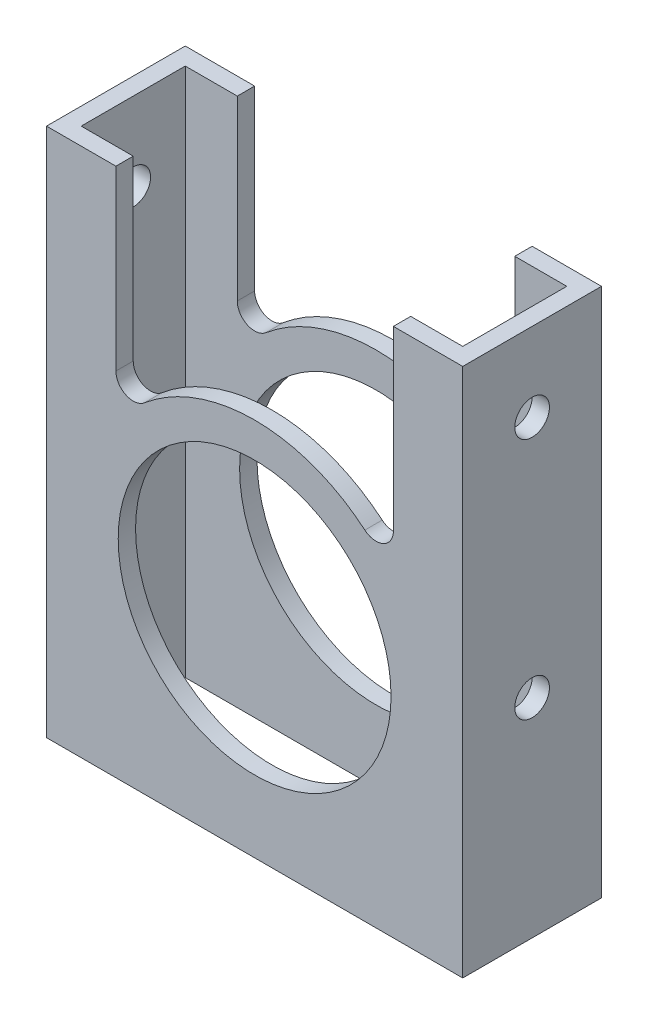
ISO-10303-21;
HEADER;
FILE_DESCRIPTION(('STEP AP214'),'2;1');
FILE_NAME('part.step','',(''),(''),'','','');
FILE_SCHEMA(('AUTOMOTIVE_DESIGN { 1 0 10303 214 1 1 1 1 }'));
ENDSEC;
DATA;
#1=APPLICATION_CONTEXT('core data for automotive mechanical design processes');
#2=APPLICATION_PROTOCOL_DEFINITION('international standard','automotive_design',2000,#1);
#3=PRODUCT_CONTEXT('',#1,'mechanical');
#4=PRODUCT('Part','Part','',(#3));
#5=PRODUCT_RELATED_PRODUCT_CATEGORY('part','',(#4));
#6=PRODUCT_DEFINITION_FORMATION('','',#4);
#7=PRODUCT_DEFINITION_CONTEXT('part definition',#1,'design');
#8=PRODUCT_DEFINITION('design','',#6,#7);
#9=PRODUCT_DEFINITION_SHAPE('','',#8);
#10=(LENGTH_UNIT() NAMED_UNIT(*) SI_UNIT(.MILLI.,.METRE.));
#11=(NAMED_UNIT(*) PLANE_ANGLE_UNIT() SI_UNIT($,.RADIAN.));
#12=(NAMED_UNIT(*) SI_UNIT($,.STERADIAN.) SOLID_ANGLE_UNIT());
#13=UNCERTAINTY_MEASURE_WITH_UNIT(LENGTH_MEASURE(1.E-05),#10,'distance_accuracy_value','');
#14=(GEOMETRIC_REPRESENTATION_CONTEXT(3) GLOBAL_UNCERTAINTY_ASSIGNED_CONTEXT((#13)) GLOBAL_UNIT_ASSIGNED_CONTEXT((#10,
#11,#12)) REPRESENTATION_CONTEXT('',''));
#15=CARTESIAN_POINT('',(0.,0.,0.));
#16=DIRECTION('',(0.,0.,1.));
#17=DIRECTION('',(1.,0.,0.));
#18=AXIS2_PLACEMENT_3D('',#15,#16,#17);
#19=CARTESIAN_POINT('',(0.,-50.8,0.));
#20=DIRECTION('',(0.,1.,0.));
#21=DIRECTION('',(0.,0.,1.));
#22=AXIS2_PLACEMENT_3D('',#19,#20,#21);
#23=PLANE('',#22);
#24=DIRECTION('',(0.,0.,1.));
#25=VECTOR('',#24,1.);
#26=CARTESIAN_POINT('',(0.,-50.8,0.));
#27=LINE('',#26,#25);
#28=CARTESIAN_POINT('',(0.,-50.8,-25.4));
#29=VERTEX_POINT('',#28);
#30=CARTESIAN_POINT('',(0.,-50.8,0.));
#31=VERTEX_POINT('',#30);
#32=EDGE_CURVE('E364',#29,#31,#27,.T.);
#33=ORIENTED_EDGE('',*,*,#32,.F.);
#34=DIRECTION('',(-1.,0.,0.));
#35=VECTOR('',#34,1.);
#36=CARTESIAN_POINT('',(0.,-50.8,-25.4));
#37=LINE('',#36,#35);
#38=CARTESIAN_POINT('',(76.2,-50.8,-25.4));
#39=VERTEX_POINT('',#38);
#40=EDGE_CURVE('E370',#39,#29,#37,.T.);
#41=ORIENTED_EDGE('',*,*,#40,.F.);
#42=DIRECTION('',(0.,0.,-1.));
#43=VECTOR('',#42,1.);
#44=CARTESIAN_POINT('',(76.2,-50.8,0.));
#45=LINE('',#44,#43);
#46=CARTESIAN_POINT('',(76.2,-50.8,0.));
#47=VERTEX_POINT('',#46);
#48=EDGE_CURVE('E368',#47,#39,#45,.T.);
#49=ORIENTED_EDGE('',*,*,#48,.F.);
#50=DIRECTION('',(1.,0.,0.));
#51=VECTOR('',#50,1.);
#52=CARTESIAN_POINT('',(0.,-50.8,0.));
#53=LINE('',#52,#51);
#54=EDGE_CURVE('E219',#31,#47,#53,.T.);
#55=ORIENTED_EDGE('',*,*,#54,.F.);
#56=EDGE_LOOP('',(#33,#41,#49,#55));
#57=FACE_BOUND('',#56,.T.);
#58=DIRECTION('',(0.,0.,1.));
#59=VECTOR('',#58,1.);
#60=CARTESIAN_POINT('',(3.175,-50.8,0.));
#61=LINE('',#60,#59);
#62=CARTESIAN_POINT('',(3.175,-50.8,-22.225));
#63=VERTEX_POINT('',#62);
#64=CARTESIAN_POINT('',(3.175,-50.8,-3.175));
#65=VERTEX_POINT('',#64);
#66=EDGE_CURVE('E344',#63,#65,#61,.T.);
#67=ORIENTED_EDGE('',*,*,#66,.T.);
#68=DIRECTION('',(1.,0.,0.));
#69=VECTOR('',#68,1.);
#70=CARTESIAN_POINT('',(0.,-50.8,-3.175));
#71=LINE('',#70,#69);
#72=CARTESIAN_POINT('',(73.025,-50.8,-3.175));
#73=VERTEX_POINT('',#72);
#74=EDGE_CURVE('E347',#65,#73,#71,.T.);
#75=ORIENTED_EDGE('',*,*,#74,.T.);
#76=DIRECTION('',(0.,0.,-1.));
#77=VECTOR('',#76,1.);
#78=CARTESIAN_POINT('',(73.025,-50.8,0.));
#79=LINE('',#78,#77);
#80=CARTESIAN_POINT('',(73.025,-50.8,-22.225));
#81=VERTEX_POINT('',#80);
#82=EDGE_CURVE('E350',#73,#81,#79,.T.);
#83=ORIENTED_EDGE('',*,*,#82,.T.);
#84=DIRECTION('',(-1.,0.,0.));
#85=VECTOR('',#84,1.);
#86=CARTESIAN_POINT('',(0.,-50.8,-22.225));
#87=LINE('',#86,#85);
#88=EDGE_CURVE('E353',#81,#63,#87,.T.);
#89=ORIENTED_EDGE('',*,*,#88,.T.);
#90=EDGE_LOOP('',(#67,#75,#83,#89));
#91=FACE_BOUND('',#90,.T.);
#92=ADVANCED_FACE('F61',(#57,#91),#23,.F.);
#93=CARTESIAN_POINT('',(0.,50.8,0.));
#94=DIRECTION('',(1.,0.,0.));
#95=DIRECTION('',(0.,0.,-1.));
#96=AXIS2_PLACEMENT_3D('',#93,#94,#95);
#97=PLANE('',#96);
#98=CARTESIAN_POINT('',(0.,-12.7,-12.7));
#99=DIRECTION('',(-1.,0.,0.));
#100=DIRECTION('',(0.,0.,1.));
#101=AXIS2_PLACEMENT_3D('',#98,#99,#100);
#102=CIRCLE('',#101,3.175);
#103=CARTESIAN_POINT('',(0.,-12.7,-9.525));
#104=VERTEX_POINT('',#103);
#105=EDGE_CURVE('E507',#104,#104,#102,.T.);
#106=ORIENTED_EDGE('',*,*,#105,.F.);
#107=EDGE_LOOP('',(#106));
#108=FACE_BOUND('',#107,.T.);
#109=CARTESIAN_POINT('',(0.,31.75,-12.7));
#110=DIRECTION('',(-1.,0.,0.));
#111=DIRECTION('',(0.,0.,1.));
#112=AXIS2_PLACEMENT_3D('',#109,#110,#111);
#113=CIRCLE('',#112,3.175);
#114=CARTESIAN_POINT('',(0.,31.75,-9.525));
#115=VERTEX_POINT('',#114);
#116=EDGE_CURVE('E256',#115,#115,#113,.T.);
#117=ORIENTED_EDGE('',*,*,#116,.F.);
#118=EDGE_LOOP('',(#117));
#119=FACE_BOUND('',#118,.T.);
#120=DIRECTION('',(0.,-1.,0.));
#121=VECTOR('',#120,1.);
#122=CARTESIAN_POINT('',(0.,50.8,0.));
#123=LINE('',#122,#121);
#124=CARTESIAN_POINT('',(0.,46.1645,0.));
#125=VERTEX_POINT('',#124);
#126=EDGE_CURVE('E221',#125,#31,#123,.T.);
#127=ORIENTED_EDGE('',*,*,#126,.F.);
#128=DIRECTION('',(0.,0.,-1.));
#129=VECTOR('',#128,1.);
#130=CARTESIAN_POINT('',(0.,46.1645,0.));
#131=LINE('',#130,#129);
#132=CARTESIAN_POINT('',(0.,46.1645,-25.4));
#133=VERTEX_POINT('',#132);
#134=EDGE_CURVE('E292',#125,#133,#131,.T.);
#135=ORIENTED_EDGE('',*,*,#134,.T.);
#136=DIRECTION('',(0.,-1.,0.));
#137=VECTOR('',#136,1.);
#138=CARTESIAN_POINT('',(0.,50.8,-25.4));
#139=LINE('',#138,#137);
#140=EDGE_CURVE('E225',#133,#29,#139,.T.);
#141=ORIENTED_EDGE('',*,*,#140,.T.);
#142=ORIENTED_EDGE('',*,*,#32,.T.);
#143=EDGE_LOOP('',(#127,#135,#141,#142));
#144=FACE_BOUND('',#143,.T.);
#145=ADVANCED_FACE('F63',(#108,#119,#144),#97,.F.);
#146=CARTESIAN_POINT('',(0.,50.8,0.));
#147=DIRECTION('',(0.,0.,-1.));
#148=DIRECTION('',(-1.,0.,0.));
#149=AXIS2_PLACEMENT_3D('',#146,#147,#148);
#150=PLANE('',#149);
#151=CARTESIAN_POINT('',(38.1,-12.7,0.));
#152=DIRECTION('',(0.,0.,-1.));
#153=DIRECTION('',(-1.,0.,0.));
#154=AXIS2_PLACEMENT_3D('',#151,#152,#153);
#155=CIRCLE('',#154,24.97201);
#156=CARTESIAN_POINT('',(13.12799,-12.7,0.));
#157=VERTEX_POINT('',#156);
#158=EDGE_CURVE('E341',#157,#157,#155,.T.);
#159=ORIENTED_EDGE('',*,*,#158,.T.);
#160=EDGE_LOOP('',(#159));
#161=FACE_BOUND('',#160,.T.);
#162=DIRECTION('',(0.,-1.,0.));
#163=VECTOR('',#162,1.);
#164=CARTESIAN_POINT('',(12.7,0.,0.));
#165=LINE('',#164,#163);
#166=CARTESIAN_POINT('',(12.7,46.1645,0.));
#167=VERTEX_POINT('',#166);
#168=CARTESIAN_POINT('',(12.7,13.6835758368744,0.));
#169=VERTEX_POINT('',#168);
#170=EDGE_CURVE('E274',#167,#169,#165,.T.);
#171=ORIENTED_EDGE('',*,*,#170,.F.);
#172=DIRECTION('',(-1.,0.,0.));
#173=VECTOR('',#172,1.);
#174=CARTESIAN_POINT('',(0.,46.1645,0.));
#175=LINE('',#174,#173);
#176=EDGE_CURVE('E207',#167,#125,#175,.T.);
#177=ORIENTED_EDGE('',*,*,#176,.T.);
#178=ORIENTED_EDGE('',*,*,#126,.T.);
#179=ORIENTED_EDGE('',*,*,#54,.T.);
#180=DIRECTION('',(0.,-1.,0.));
#181=VECTOR('',#180,1.);
#182=CARTESIAN_POINT('',(76.2,50.8,0.));
#183=LINE('',#182,#181);
#184=CARTESIAN_POINT('',(76.2,46.1645,0.));
#185=VERTEX_POINT('',#184);
#186=EDGE_CURVE('E212',#185,#47,#183,.T.);
#187=ORIENTED_EDGE('',*,*,#186,.F.);
#188=CARTESIAN_POINT('',(63.5,46.1645,0.));
#189=VERTEX_POINT('',#188);
#190=EDGE_CURVE('E196',#185,#189,#175,.T.);
#191=ORIENTED_EDGE('',*,*,#190,.T.);
#192=DIRECTION('',(0.,-1.,0.));
#193=VECTOR('',#192,1.);
#194=CARTESIAN_POINT('',(63.5,0.,0.));
#195=LINE('',#194,#193);
#196=CARTESIAN_POINT('',(63.5,13.6835758368744,0.));
#197=VERTEX_POINT('',#196);
#198=EDGE_CURVE('E204',#189,#197,#195,.T.);
#199=ORIENTED_EDGE('',*,*,#198,.T.);
#200=CARTESIAN_POINT('',(60.325,13.6835758368744,0.));
#201=DIRECTION('',(0.,0.,-1.));
#202=DIRECTION('',(-1.,0.,0.));
#203=AXIS2_PLACEMENT_3D('',#200,#201,#202);
#204=CIRCLE('',#203,3.175);
#205=CARTESIAN_POINT('',(58.2794785185731,11.2553116689921,0.));
#206=VERTEX_POINT('',#205);
#207=EDGE_CURVE('E267',#206,#197,#204,.F.);
#208=ORIENTED_EDGE('',*,*,#207,.F.);
#209=CARTESIAN_POINT('',(38.1,-12.7,0.));
#210=DIRECTION('',(0.,0.,-1.));
#211=DIRECTION('',(-1.,0.,0.));
#212=AXIS2_PLACEMENT_3D('',#209,#210,#211);
#213=CIRCLE('',#212,31.32201);
#214=CARTESIAN_POINT('',(17.9205214814269,11.2553116689921,0.));
#215=VERTEX_POINT('',#214);
#216=EDGE_CURVE('E269',#215,#206,#213,.T.);
#217=ORIENTED_EDGE('',*,*,#216,.F.);
#218=CARTESIAN_POINT('',(15.875,13.6835758368744,0.));
#219=DIRECTION('',(0.,0.,-1.));
#220=DIRECTION('',(-1.,0.,0.));
#221=AXIS2_PLACEMENT_3D('',#218,#219,#220);
#222=CIRCLE('',#221,3.175);
#223=EDGE_CURVE('E271',#215,#169,#222,.T.);
#224=ORIENTED_EDGE('',*,*,#223,.T.);
#225=EDGE_LOOP('',(#171,#177,#178,#179,#187,#191,#199,#208,#217,#224));
#226=FACE_BOUND('',#225,.T.);
#227=ADVANCED_FACE('F217',(#161,#226),#150,.F.);
#228=CARTESIAN_POINT('',(76.2,50.8,0.));
#229=DIRECTION('',(-1.,0.,0.));
#230=DIRECTION('',(0.,0.,1.));
#231=AXIS2_PLACEMENT_3D('',#228,#229,#230);
#232=PLANE('',#231);
#233=CARTESIAN_POINT('',(76.2,-12.7,-12.7));
#234=DIRECTION('',(-1.,0.,0.));
#235=DIRECTION('',(0.,0.,1.));
#236=AXIS2_PLACEMENT_3D('',#233,#234,#235);
#237=CIRCLE('',#236,3.175);
#238=CARTESIAN_POINT('',(76.2,-12.7,-9.525));
#239=VERTEX_POINT('',#238);
#240=EDGE_CURVE('E505',#239,#239,#237,.T.);
#241=ORIENTED_EDGE('',*,*,#240,.T.);
#242=EDGE_LOOP('',(#241));
#243=FACE_BOUND('',#242,.T.);
#244=CARTESIAN_POINT('',(76.2,31.75,-12.7));
#245=DIRECTION('',(-1.,0.,0.));
#246=DIRECTION('',(0.,0.,1.));
#247=AXIS2_PLACEMENT_3D('',#244,#245,#246);
#248=CIRCLE('',#247,3.175);
#249=CARTESIAN_POINT('',(76.2,31.75,-9.525));
#250=VERTEX_POINT('',#249);
#251=EDGE_CURVE('E249',#250,#250,#248,.T.);
#252=ORIENTED_EDGE('',*,*,#251,.T.);
#253=EDGE_LOOP('',(#252));
#254=FACE_BOUND('',#253,.T.);
#255=DIRECTION('',(0.,-1.,0.));
#256=VECTOR('',#255,1.);
#257=CARTESIAN_POINT('',(76.2,50.8,-25.4));
#258=LINE('',#257,#256);
#259=CARTESIAN_POINT('',(76.2,46.1645,-25.4));
#260=VERTEX_POINT('',#259);
#261=EDGE_CURVE('E214',#260,#39,#258,.T.);
#262=ORIENTED_EDGE('',*,*,#261,.F.);
#263=DIRECTION('',(0.,0.,-1.));
#264=VECTOR('',#263,1.);
#265=CARTESIAN_POINT('',(76.2,46.1645,0.));
#266=LINE('',#265,#264);
#267=EDGE_CURVE('E78',#185,#260,#266,.T.);
#268=ORIENTED_EDGE('',*,*,#267,.F.);
#269=ORIENTED_EDGE('',*,*,#186,.T.);
#270=ORIENTED_EDGE('',*,*,#48,.T.);
#271=EDGE_LOOP('',(#262,#268,#269,#270));
#272=FACE_BOUND('',#271,.T.);
#273=ADVANCED_FACE('F210',(#243,#254,#272),#232,.F.);
#274=CARTESIAN_POINT('',(0.,50.8,-25.4));
#275=DIRECTION('',(0.,0.,1.));
#276=DIRECTION('',(1.,0.,0.));
#277=AXIS2_PLACEMENT_3D('',#274,#275,#276);
#278=PLANE('',#277);
#279=CARTESIAN_POINT('',(38.1,-12.7,-25.4));
#280=DIRECTION('',(0.,0.,-1.));
#281=DIRECTION('',(-1.,0.,0.));
#282=AXIS2_PLACEMENT_3D('',#279,#280,#281);
#283=CIRCLE('',#282,24.97201);
#284=CARTESIAN_POINT('',(13.12799,-12.7,-25.4));
#285=VERTEX_POINT('',#284);
#286=EDGE_CURVE('E233',#285,#285,#283,.T.);
#287=ORIENTED_EDGE('',*,*,#286,.F.);
#288=EDGE_LOOP('',(#287));
#289=FACE_BOUND('',#288,.T.);
#290=ORIENTED_EDGE('',*,*,#140,.F.);
#291=DIRECTION('',(-1.,0.,0.));
#292=VECTOR('',#291,1.);
#293=CARTESIAN_POINT('',(0.,46.1645,-25.4));
#294=LINE('',#293,#292);
#295=CARTESIAN_POINT('',(12.7,46.1645,-25.4));
#296=VERTEX_POINT('',#295);
#297=EDGE_CURVE('E205',#296,#133,#294,.T.);
#298=ORIENTED_EDGE('',*,*,#297,.F.);
#299=DIRECTION('',(0.,-1.,0.));
#300=VECTOR('',#299,1.);
#301=CARTESIAN_POINT('',(12.7,0.,-25.4));
#302=LINE('',#301,#300);
#303=CARTESIAN_POINT('',(12.7,13.6835758368744,-25.4));
#304=VERTEX_POINT('',#303);
#305=EDGE_CURVE('E289',#296,#304,#302,.T.);
#306=ORIENTED_EDGE('',*,*,#305,.T.);
#307=CARTESIAN_POINT('',(15.875,13.6835758368744,-25.4));
#308=DIRECTION('',(0.,0.,-1.));
#309=DIRECTION('',(-1.,0.,0.));
#310=AXIS2_PLACEMENT_3D('',#307,#308,#309);
#311=CIRCLE('',#310,3.175);
#312=CARTESIAN_POINT('',(17.9205214814269,11.2553116689921,-25.4));
#313=VERTEX_POINT('',#312);
#314=EDGE_CURVE('E286',#313,#304,#311,.T.);
#315=ORIENTED_EDGE('',*,*,#314,.F.);
#316=CARTESIAN_POINT('',(38.1,-12.7,-25.4));
#317=DIRECTION('',(0.,0.,-1.));
#318=DIRECTION('',(-1.,0.,0.));
#319=AXIS2_PLACEMENT_3D('',#316,#317,#318);
#320=CIRCLE('',#319,31.32201);
#321=CARTESIAN_POINT('',(58.2794785185731,11.2553116689921,-25.4));
#322=VERTEX_POINT('',#321);
#323=EDGE_CURVE('E283',#313,#322,#320,.T.);
#324=ORIENTED_EDGE('',*,*,#323,.T.);
#325=CARTESIAN_POINT('',(60.325,13.6835758368744,-25.4));
#326=DIRECTION('',(0.,0.,-1.));
#327=DIRECTION('',(-1.,0.,0.));
#328=AXIS2_PLACEMENT_3D('',#325,#326,#327);
#329=CIRCLE('',#328,3.175);
#330=CARTESIAN_POINT('',(63.5,13.6835758368744,-25.4));
#331=VERTEX_POINT('',#330);
#332=EDGE_CURVE('E280',#322,#331,#329,.F.);
#333=ORIENTED_EDGE('',*,*,#332,.T.);
#334=DIRECTION('',(0.,-1.,0.));
#335=VECTOR('',#334,1.);
#336=CARTESIAN_POINT('',(63.5,0.,-25.4));
#337=LINE('',#336,#335);
#338=CARTESIAN_POINT('',(63.5,46.1645,-25.4));
#339=VERTEX_POINT('',#338);
#340=EDGE_CURVE('E277',#339,#331,#337,.T.);
#341=ORIENTED_EDGE('',*,*,#340,.F.);
#342=EDGE_CURVE('E253',#260,#339,#294,.T.);
#343=ORIENTED_EDGE('',*,*,#342,.F.);
#344=ORIENTED_EDGE('',*,*,#261,.T.);
#345=ORIENTED_EDGE('',*,*,#40,.T.);
#346=EDGE_LOOP('',(#290,#298,#306,#315,#324,#333,#341,#343,#344,#345));
#347=FACE_BOUND('',#346,.T.);
#348=ADVANCED_FACE('F379',(#289,#347),#278,.F.);
#349=CARTESIAN_POINT('',(3.175,50.8,0.));
#350=DIRECTION('',(1.,0.,0.));
#351=DIRECTION('',(0.,0.,-1.));
#352=AXIS2_PLACEMENT_3D('',#349,#350,#351);
#353=PLANE('',#352);
#354=CARTESIAN_POINT('',(3.175,-12.7,-12.7));
#355=DIRECTION('',(1.,0.,0.));
#356=DIRECTION('',(0.,0.,-1.));
#357=AXIS2_PLACEMENT_3D('',#354,#355,#356);
#358=CIRCLE('',#357,3.175);
#359=CARTESIAN_POINT('',(3.175,-12.7,-15.875));
#360=VERTEX_POINT('',#359);
#361=EDGE_CURVE('E261',#360,#360,#358,.T.);
#362=ORIENTED_EDGE('',*,*,#361,.F.);
#363=EDGE_LOOP('',(#362));
#364=FACE_BOUND('',#363,.T.);
#365=CARTESIAN_POINT('',(3.175,31.75,-12.7));
#366=DIRECTION('',(1.,0.,0.));
#367=DIRECTION('',(0.,0.,-1.));
#368=AXIS2_PLACEMENT_3D('',#365,#366,#367);
#369=CIRCLE('',#368,3.175);
#370=CARTESIAN_POINT('',(3.175,31.75,-15.875));
#371=VERTEX_POINT('',#370);
#372=EDGE_CURVE('E248',#371,#371,#369,.T.);
#373=ORIENTED_EDGE('',*,*,#372,.F.);
#374=EDGE_LOOP('',(#373));
#375=FACE_BOUND('',#374,.T.);
#376=DIRECTION('',(0.,0.,-1.));
#377=VECTOR('',#376,1.);
#378=CARTESIAN_POINT('',(3.175,46.1645,0.));
#379=LINE('',#378,#377);
#380=CARTESIAN_POINT('',(3.175,46.1645,-3.175));
#381=VERTEX_POINT('',#380);
#382=CARTESIAN_POINT('',(3.175,46.1645,-22.225));
#383=VERTEX_POINT('',#382);
#384=EDGE_CURVE('E333',#381,#383,#379,.T.);
#385=ORIENTED_EDGE('',*,*,#384,.F.);
#386=DIRECTION('',(0.,-1.,0.));
#387=VECTOR('',#386,1.);
#388=CARTESIAN_POINT('',(3.175,50.8,-3.175));
#389=LINE('',#388,#387);
#390=EDGE_CURVE('E362',#381,#65,#389,.T.);
#391=ORIENTED_EDGE('',*,*,#390,.T.);
#392=ORIENTED_EDGE('',*,*,#66,.F.);
#393=DIRECTION('',(0.,-1.,0.));
#394=VECTOR('',#393,1.);
#395=CARTESIAN_POINT('',(3.175,50.8,-22.225));
#396=LINE('',#395,#394);
#397=EDGE_CURVE('E356',#383,#63,#396,.T.);
#398=ORIENTED_EDGE('',*,*,#397,.F.);
#399=EDGE_LOOP('',(#385,#391,#392,#398));
#400=FACE_BOUND('',#399,.T.);
#401=ADVANCED_FACE('F390',(#364,#375,#400),#353,.T.);
#402=CARTESIAN_POINT('',(0.,50.8,-3.175));
#403=DIRECTION('',(0.,0.,-1.));
#404=DIRECTION('',(-1.,0.,0.));
#405=AXIS2_PLACEMENT_3D('',#402,#403,#404);
#406=PLANE('',#405);
#407=DIRECTION('',(-1.,0.,0.));
#408=VECTOR('',#407,1.);
#409=CARTESIAN_POINT('',(0.,46.1645,-3.175));
#410=LINE('',#409,#408);
#411=CARTESIAN_POINT('',(12.7,46.1645,-3.175));
#412=VERTEX_POINT('',#411);
#413=EDGE_CURVE('E335',#412,#381,#410,.T.);
#414=ORIENTED_EDGE('',*,*,#413,.F.);
#415=DIRECTION('',(0.,-1.,0.));
#416=VECTOR('',#415,1.);
#417=CARTESIAN_POINT('',(12.7,50.8,-3.175));
#418=LINE('',#417,#416);
#419=CARTESIAN_POINT('',(12.7,13.6835758368744,-3.175));
#420=VERTEX_POINT('',#419);
#421=EDGE_CURVE('E330',#412,#420,#418,.T.);
#422=ORIENTED_EDGE('',*,*,#421,.T.);
#423=CARTESIAN_POINT('',(15.875,13.6835758368744,-3.175));
#424=DIRECTION('',(0.,0.,-1.));
#425=DIRECTION('',(-1.,0.,0.));
#426=AXIS2_PLACEMENT_3D('',#423,#424,#425);
#427=CIRCLE('',#426,3.175);
#428=CARTESIAN_POINT('',(17.9205214814269,11.2553116689921,-3.175));
#429=VERTEX_POINT('',#428);
#430=EDGE_CURVE('E328',#429,#420,#427,.T.);
#431=ORIENTED_EDGE('',*,*,#430,.F.);
#432=CARTESIAN_POINT('',(38.1,-12.7,-3.175));
#433=DIRECTION('',(0.,0.,-1.));
#434=DIRECTION('',(-1.,0.,0.));
#435=AXIS2_PLACEMENT_3D('',#432,#433,#434);
#436=CIRCLE('',#435,31.32201);
#437=CARTESIAN_POINT('',(58.2794785185731,11.2553116689921,-3.175));
#438=VERTEX_POINT('',#437);
#439=EDGE_CURVE('E325',#429,#438,#436,.T.);
#440=ORIENTED_EDGE('',*,*,#439,.T.);
#441=CARTESIAN_POINT('',(60.325,13.6835758368744,-3.175));
#442=DIRECTION('',(0.,0.,-1.));
#443=DIRECTION('',(-1.,0.,0.));
#444=AXIS2_PLACEMENT_3D('',#441,#442,#443);
#445=CIRCLE('',#444,3.175);
#446=CARTESIAN_POINT('',(63.5,13.6835758368744,-3.175));
#447=VERTEX_POINT('',#446);
#448=EDGE_CURVE('E322',#438,#447,#445,.F.);
#449=ORIENTED_EDGE('',*,*,#448,.T.);
#450=DIRECTION('',(0.,-1.,0.));
#451=VECTOR('',#450,1.);
#452=CARTESIAN_POINT('',(63.5,50.8,-3.175));
#453=LINE('',#452,#451);
#454=CARTESIAN_POINT('',(63.5,46.1645,-3.175));
#455=VERTEX_POINT('',#454);
#456=EDGE_CURVE('E320',#455,#447,#453,.T.);
#457=ORIENTED_EDGE('',*,*,#456,.F.);
#458=DIRECTION('',(-1.,0.,0.));
#459=VECTOR('',#458,1.);
#460=CARTESIAN_POINT('',(0.,46.1645,-3.175));
#461=LINE('',#460,#459);
#462=CARTESIAN_POINT('',(73.025,46.1645,-3.175));
#463=VERTEX_POINT('',#462);
#464=EDGE_CURVE('E318',#463,#455,#461,.T.);
#465=ORIENTED_EDGE('',*,*,#464,.F.);
#466=DIRECTION('',(0.,-1.,0.));
#467=VECTOR('',#466,1.);
#468=CARTESIAN_POINT('',(73.025,50.8,-3.175));
#469=LINE('',#468,#467);
#470=EDGE_CURVE('E360',#463,#73,#469,.T.);
#471=ORIENTED_EDGE('',*,*,#470,.T.);
#472=ORIENTED_EDGE('',*,*,#74,.F.);
#473=ORIENTED_EDGE('',*,*,#390,.F.);
#474=EDGE_LOOP('',(#414,#422,#431,#440,#449,#457,#465,#471,#472,#473));
#475=FACE_BOUND('',#474,.T.);
#476=CARTESIAN_POINT('',(38.1,-12.7,-3.175));
#477=DIRECTION('',(0.,0.,-1.));
#478=DIRECTION('',(-1.,0.,0.));
#479=AXIS2_PLACEMENT_3D('',#476,#477,#478);
#480=CIRCLE('',#479,24.97201);
#481=CARTESIAN_POINT('',(13.12799,-12.7,-3.175));
#482=VERTEX_POINT('',#481);
#483=EDGE_CURVE('E232',#482,#482,#480,.T.);
#484=ORIENTED_EDGE('',*,*,#483,.F.);
#485=EDGE_LOOP('',(#484));
#486=FACE_BOUND('',#485,.T.);
#487=ADVANCED_FACE('F394',(#475,#486),#406,.T.);
#488=CARTESIAN_POINT('',(73.025,50.8,0.));
#489=DIRECTION('',(-1.,0.,0.));
#490=DIRECTION('',(0.,0.,1.));
#491=AXIS2_PLACEMENT_3D('',#488,#489,#490);
#492=PLANE('',#491);
#493=CARTESIAN_POINT('',(73.025,-12.7,-12.7));
#494=DIRECTION('',(-1.,0.,0.));
#495=DIRECTION('',(0.,0.,1.));
#496=AXIS2_PLACEMENT_3D('',#493,#494,#495);
#497=CIRCLE('',#496,3.175);
#498=CARTESIAN_POINT('',(73.025,-12.7,-9.525));
#499=VERTEX_POINT('',#498);
#500=EDGE_CURVE('E65',#499,#499,#497,.T.);
#501=ORIENTED_EDGE('',*,*,#500,.F.);
#502=EDGE_LOOP('',(#501));
#503=FACE_BOUND('',#502,.T.);
#504=CARTESIAN_POINT('',(73.025,31.75,-12.7));
#505=DIRECTION('',(-1.,0.,0.));
#506=DIRECTION('',(0.,0.,1.));
#507=AXIS2_PLACEMENT_3D('',#504,#505,#506);
#508=CIRCLE('',#507,3.175);
#509=CARTESIAN_POINT('',(73.025,31.75,-9.525));
#510=VERTEX_POINT('',#509);
#511=EDGE_CURVE('E246',#510,#510,#508,.T.);
#512=ORIENTED_EDGE('',*,*,#511,.F.);
#513=EDGE_LOOP('',(#512));
#514=FACE_BOUND('',#513,.T.);
#515=DIRECTION('',(0.,0.,1.));
#516=VECTOR('',#515,1.);
#517=CARTESIAN_POINT('',(73.025,46.1645,0.));
#518=LINE('',#517,#516);
#519=CARTESIAN_POINT('',(73.025,46.1645,-22.225));
#520=VERTEX_POINT('',#519);
#521=EDGE_CURVE('E295',#520,#463,#518,.T.);
#522=ORIENTED_EDGE('',*,*,#521,.F.);
#523=DIRECTION('',(0.,-1.,0.));
#524=VECTOR('',#523,1.);
#525=CARTESIAN_POINT('',(73.025,50.8,-22.225));
#526=LINE('',#525,#524);
#527=EDGE_CURVE('E358',#520,#81,#526,.T.);
#528=ORIENTED_EDGE('',*,*,#527,.T.);
#529=ORIENTED_EDGE('',*,*,#82,.F.);
#530=ORIENTED_EDGE('',*,*,#470,.F.);
#531=EDGE_LOOP('',(#522,#528,#529,#530));
#532=FACE_BOUND('',#531,.T.);
#533=ADVANCED_FACE('F402',(#503,#514,#532),#492,.T.);
#534=CARTESIAN_POINT('',(0.,50.8,-22.225));
#535=DIRECTION('',(0.,0.,1.));
#536=DIRECTION('',(1.,0.,0.));
#537=AXIS2_PLACEMENT_3D('',#534,#535,#536);
#538=PLANE('',#537);
#539=DIRECTION('',(1.,0.,0.));
#540=VECTOR('',#539,1.);
#541=CARTESIAN_POINT('',(0.,46.1645,-22.225));
#542=LINE('',#541,#540);
#543=CARTESIAN_POINT('',(12.7,46.1645,-22.225));
#544=VERTEX_POINT('',#543);
#545=EDGE_CURVE('E12',#383,#544,#542,.T.);
#546=ORIENTED_EDGE('',*,*,#545,.F.);
#547=ORIENTED_EDGE('',*,*,#397,.T.);
#548=ORIENTED_EDGE('',*,*,#88,.F.);
#549=ORIENTED_EDGE('',*,*,#527,.F.);
#550=DIRECTION('',(1.,0.,0.));
#551=VECTOR('',#550,1.);
#552=CARTESIAN_POINT('',(0.,46.1645,-22.225));
#553=LINE('',#552,#551);
#554=CARTESIAN_POINT('',(63.5,46.1645,-22.225));
#555=VERTEX_POINT('',#554);
#556=EDGE_CURVE('E223',#555,#520,#553,.T.);
#557=ORIENTED_EDGE('',*,*,#556,.F.);
#558=DIRECTION('',(0.,1.,0.));
#559=VECTOR('',#558,1.);
#560=CARTESIAN_POINT('',(63.5,50.8,-22.225));
#561=LINE('',#560,#559);
#562=CARTESIAN_POINT('',(63.5,13.6835758368744,-22.225));
#563=VERTEX_POINT('',#562);
#564=EDGE_CURVE('E235',#563,#555,#561,.T.);
#565=ORIENTED_EDGE('',*,*,#564,.F.);
#566=CARTESIAN_POINT('',(60.325,13.6835758368744,-22.225));
#567=DIRECTION('',(0.,0.,1.));
#568=DIRECTION('',(1.,0.,0.));
#569=AXIS2_PLACEMENT_3D('',#566,#567,#568);
#570=CIRCLE('',#569,3.175);
#571=CARTESIAN_POINT('',(58.2794785185731,11.2553116689921,-22.225));
#572=VERTEX_POINT('',#571);
#573=EDGE_CURVE('E237',#563,#572,#570,.F.);
#574=ORIENTED_EDGE('',*,*,#573,.T.);
#575=CARTESIAN_POINT('',(38.1,-12.7,-22.225));
#576=DIRECTION('',(0.,0.,1.));
#577=DIRECTION('',(1.,0.,0.));
#578=AXIS2_PLACEMENT_3D('',#575,#576,#577);
#579=CIRCLE('',#578,31.32201);
#580=CARTESIAN_POINT('',(17.9205214814269,11.2553116689921,-22.225));
#581=VERTEX_POINT('',#580);
#582=EDGE_CURVE('E240',#572,#581,#579,.T.);
#583=ORIENTED_EDGE('',*,*,#582,.T.);
#584=CARTESIAN_POINT('',(15.875,13.6835758368744,-22.225));
#585=DIRECTION('',(0.,0.,1.));
#586=DIRECTION('',(1.,0.,0.));
#587=AXIS2_PLACEMENT_3D('',#584,#585,#586);
#588=CIRCLE('',#587,3.175);
#589=CARTESIAN_POINT('',(12.7,13.6835758368744,-22.225));
#590=VERTEX_POINT('',#589);
#591=EDGE_CURVE('E243',#590,#581,#588,.T.);
#592=ORIENTED_EDGE('',*,*,#591,.F.);
#593=DIRECTION('',(0.,1.,0.));
#594=VECTOR('',#593,1.);
#595=CARTESIAN_POINT('',(12.7,50.8,-22.225));
#596=LINE('',#595,#594);
#597=EDGE_CURVE('E70',#590,#544,#596,.T.);
#598=ORIENTED_EDGE('',*,*,#597,.T.);
#599=EDGE_LOOP('',(#546,#547,#548,#549,#557,#565,#574,#583,#592,#598));
#600=FACE_BOUND('',#599,.T.);
#601=CARTESIAN_POINT('',(38.1,-12.7,-22.225));
#602=DIRECTION('',(0.,0.,1.));
#603=DIRECTION('',(1.,0.,0.));
#604=AXIS2_PLACEMENT_3D('',#601,#602,#603);
#605=CIRCLE('',#604,24.97201);
#606=CARTESIAN_POINT('',(63.07201,-12.7,-22.225));
#607=VERTEX_POINT('',#606);
#608=EDGE_CURVE('E229',#607,#607,#605,.T.);
#609=ORIENTED_EDGE('',*,*,#608,.F.);
#610=EDGE_LOOP('',(#609));
#611=FACE_BOUND('',#610,.T.);
#612=ADVANCED_FACE('F407',(#600,#611),#538,.T.);
#613=CARTESIAN_POINT('',(38.1,-12.7,27.178));
#614=DIRECTION('',(0.,0.,-1.));
#615=DIRECTION('',(-1.,0.,0.));
#616=AXIS2_PLACEMENT_3D('',#613,#614,#615);
#617=CYLINDRICAL_SURFACE('',#616,24.97201);
#618=ORIENTED_EDGE('',*,*,#608,.T.);
#619=EDGE_LOOP('',(#618));
#620=FACE_BOUND('',#619,.T.);
#621=ORIENTED_EDGE('',*,*,#286,.T.);
#622=EDGE_LOOP('',(#621));
#623=FACE_BOUND('',#622,.T.);
#624=ADVANCED_FACE('F484',(#620,#623),#617,.F.);
#625=ORIENTED_EDGE('',*,*,#483,.T.);
#626=EDGE_LOOP('',(#625));
#627=FACE_BOUND('',#626,.T.);
#628=ORIENTED_EDGE('',*,*,#158,.F.);
#629=EDGE_LOOP('',(#628));
#630=FACE_BOUND('',#629,.T.);
#631=ADVANCED_FACE('F480',(#627,#630),#617,.F.);
#632=CARTESIAN_POINT('',(12.7,0.,0.));
#633=DIRECTION('',(1.,0.,0.));
#634=DIRECTION('',(0.,1.,0.));
#635=AXIS2_PLACEMENT_3D('',#632,#633,#634);
#636=PLANE('',#635);
#637=DIRECTION('',(0.,0.,-1.));
#638=VECTOR('',#637,1.);
#639=CARTESIAN_POINT('',(12.7,46.1645,0.));
#640=LINE('',#639,#638);
#641=EDGE_CURVE('E296',#167,#412,#640,.T.);
#642=ORIENTED_EDGE('',*,*,#641,.F.);
#643=ORIENTED_EDGE('',*,*,#170,.T.);
#644=DIRECTION('',(0.,0.,-1.));
#645=VECTOR('',#644,1.);
#646=CARTESIAN_POINT('',(12.7,13.6835758368744,0.));
#647=LINE('',#646,#645);
#648=EDGE_CURVE('E300',#169,#420,#647,.T.);
#649=ORIENTED_EDGE('',*,*,#648,.T.);
#650=ORIENTED_EDGE('',*,*,#421,.F.);
#651=EDGE_LOOP('',(#642,#643,#649,#650));
#652=FACE_BOUND('',#651,.T.);
#653=ADVANCED_FACE('F424',(#652),#636,.T.);
#654=CARTESIAN_POINT('',(15.875,13.6835758368744,0.));
#655=DIRECTION('',(0.,0.,-1.));
#656=DIRECTION('',(-1.,0.,0.));
#657=AXIS2_PLACEMENT_3D('',#654,#655,#656);
#658=CYLINDRICAL_SURFACE('',#657,3.175);
#659=ORIENTED_EDGE('',*,*,#430,.T.);
#660=ORIENTED_EDGE('',*,*,#648,.F.);
#661=ORIENTED_EDGE('',*,*,#223,.F.);
#662=DIRECTION('',(0.,0.,-1.));
#663=VECTOR('',#662,1.);
#664=CARTESIAN_POINT('',(17.9205214814269,11.2553116689921,0.));
#665=LINE('',#664,#663);
#666=EDGE_CURVE('E304',#215,#429,#665,.T.);
#667=ORIENTED_EDGE('',*,*,#666,.T.);
#668=EDGE_LOOP('',(#659,#660,#661,#667));
#669=FACE_BOUND('',#668,.T.);
#670=ADVANCED_FACE('F426',(#669),#658,.F.);
#671=CARTESIAN_POINT('',(38.1,-12.7,0.));
#672=DIRECTION('',(0.,0.,-1.));
#673=DIRECTION('',(-1.,0.,0.));
#674=AXIS2_PLACEMENT_3D('',#671,#672,#673);
#675=CYLINDRICAL_SURFACE('',#674,31.32201);
#676=ORIENTED_EDGE('',*,*,#666,.F.);
#677=ORIENTED_EDGE('',*,*,#216,.T.);
#678=DIRECTION('',(0.,0.,-1.));
#679=VECTOR('',#678,1.);
#680=CARTESIAN_POINT('',(58.2794785185731,11.2553116689921,0.));
#681=LINE('',#680,#679);
#682=EDGE_CURVE('E308',#206,#438,#681,.T.);
#683=ORIENTED_EDGE('',*,*,#682,.T.);
#684=ORIENTED_EDGE('',*,*,#439,.F.);
#685=EDGE_LOOP('',(#676,#677,#683,#684));
#686=FACE_BOUND('',#685,.T.);
#687=ADVANCED_FACE('F429',(#686),#675,.T.);
#688=CARTESIAN_POINT('',(60.325,13.6835758368744,0.));
#689=DIRECTION('',(0.,0.,-1.));
#690=DIRECTION('',(-1.,0.,0.));
#691=AXIS2_PLACEMENT_3D('',#688,#689,#690);
#692=CYLINDRICAL_SURFACE('',#691,3.175);
#693=ORIENTED_EDGE('',*,*,#682,.F.);
#694=ORIENTED_EDGE('',*,*,#207,.T.);
#695=DIRECTION('',(0.,0.,-1.));
#696=VECTOR('',#695,1.);
#697=CARTESIAN_POINT('',(63.5,13.6835758368744,0.));
#698=LINE('',#697,#696);
#699=EDGE_CURVE('E312',#197,#447,#698,.T.);
#700=ORIENTED_EDGE('',*,*,#699,.T.);
#701=ORIENTED_EDGE('',*,*,#448,.F.);
#702=EDGE_LOOP('',(#693,#694,#700,#701));
#703=FACE_BOUND('',#702,.T.);
#704=ADVANCED_FACE('F433',(#703),#692,.F.);
#705=CARTESIAN_POINT('',(63.5,0.,0.));
#706=DIRECTION('',(1.,0.,0.));
#707=DIRECTION('',(0.,0.,-1.));
#708=AXIS2_PLACEMENT_3D('',#705,#706,#707);
#709=PLANE('',#708);
#710=ORIENTED_EDGE('',*,*,#456,.T.);
#711=ORIENTED_EDGE('',*,*,#699,.F.);
#712=ORIENTED_EDGE('',*,*,#198,.F.);
#713=DIRECTION('',(0.,0.,-1.));
#714=VECTOR('',#713,1.);
#715=CARTESIAN_POINT('',(63.5,46.1645,0.));
#716=LINE('',#715,#714);
#717=EDGE_CURVE('E199',#189,#455,#716,.T.);
#718=ORIENTED_EDGE('',*,*,#717,.T.);
#719=EDGE_LOOP('',(#710,#711,#712,#718));
#720=FACE_BOUND('',#719,.T.);
#721=ADVANCED_FACE('F436',(#720),#709,.F.);
#722=CARTESIAN_POINT('',(0.,46.1645,0.));
#723=DIRECTION('',(0.,-1.,0.));
#724=DIRECTION('',(0.,0.,-1.));
#725=AXIS2_PLACEMENT_3D('',#722,#723,#724);
#726=PLANE('',#725);
#727=ORIENTED_EDGE('',*,*,#413,.T.);
#728=ORIENTED_EDGE('',*,*,#384,.T.);
#729=ORIENTED_EDGE('',*,*,#545,.T.);
#730=EDGE_CURVE('E299',#544,#296,#640,.T.);
#731=ORIENTED_EDGE('',*,*,#730,.T.);
#732=ORIENTED_EDGE('',*,*,#297,.T.);
#733=ORIENTED_EDGE('',*,*,#134,.F.);
#734=ORIENTED_EDGE('',*,*,#176,.F.);
#735=ORIENTED_EDGE('',*,*,#641,.T.);
#736=EDGE_LOOP('',(#727,#728,#729,#731,#732,#733,#734,#735));
#737=FACE_BOUND('',#736,.T.);
#738=ADVANCED_FACE('F412',(#737),#726,.F.);
#739=EDGE_CURVE('E303',#590,#304,#647,.T.);
#740=ORIENTED_EDGE('',*,*,#739,.T.);
#741=ORIENTED_EDGE('',*,*,#305,.F.);
#742=ORIENTED_EDGE('',*,*,#730,.F.);
#743=ORIENTED_EDGE('',*,*,#597,.F.);
#744=EDGE_LOOP('',(#740,#741,#742,#743));
#745=FACE_BOUND('',#744,.T.);
#746=ADVANCED_FACE('F415',(#745),#636,.T.);
#747=ORIENTED_EDGE('',*,*,#591,.T.);
#748=EDGE_CURVE('E307',#581,#313,#665,.T.);
#749=ORIENTED_EDGE('',*,*,#748,.T.);
#750=ORIENTED_EDGE('',*,*,#314,.T.);
#751=ORIENTED_EDGE('',*,*,#739,.F.);
#752=EDGE_LOOP('',(#747,#749,#750,#751));
#753=FACE_BOUND('',#752,.T.);
#754=ADVANCED_FACE('F465',(#753),#658,.F.);
#755=EDGE_CURVE('E311',#572,#322,#681,.T.);
#756=ORIENTED_EDGE('',*,*,#755,.T.);
#757=ORIENTED_EDGE('',*,*,#323,.F.);
#758=ORIENTED_EDGE('',*,*,#748,.F.);
#759=ORIENTED_EDGE('',*,*,#582,.F.);
#760=EDGE_LOOP('',(#756,#757,#758,#759));
#761=FACE_BOUND('',#760,.T.);
#762=ADVANCED_FACE('F455',(#761),#675,.T.);
#763=EDGE_CURVE('E315',#563,#331,#698,.T.);
#764=ORIENTED_EDGE('',*,*,#763,.T.);
#765=ORIENTED_EDGE('',*,*,#332,.F.);
#766=ORIENTED_EDGE('',*,*,#755,.F.);
#767=ORIENTED_EDGE('',*,*,#573,.F.);
#768=EDGE_LOOP('',(#764,#765,#766,#767));
#769=FACE_BOUND('',#768,.T.);
#770=ADVANCED_FACE('F446',(#769),#692,.F.);
#771=ORIENTED_EDGE('',*,*,#564,.T.);
#772=EDGE_CURVE('E84',#555,#339,#716,.T.);
#773=ORIENTED_EDGE('',*,*,#772,.T.);
#774=ORIENTED_EDGE('',*,*,#340,.T.);
#775=ORIENTED_EDGE('',*,*,#763,.F.);
#776=EDGE_LOOP('',(#771,#773,#774,#775));
#777=FACE_BOUND('',#776,.T.);
#778=ADVANCED_FACE('F439',(#777),#709,.F.);
#779=ORIENTED_EDGE('',*,*,#464,.T.);
#780=ORIENTED_EDGE('',*,*,#717,.F.);
#781=ORIENTED_EDGE('',*,*,#190,.F.);
#782=ORIENTED_EDGE('',*,*,#267,.T.);
#783=ORIENTED_EDGE('',*,*,#342,.T.);
#784=ORIENTED_EDGE('',*,*,#772,.F.);
#785=ORIENTED_EDGE('',*,*,#556,.T.);
#786=ORIENTED_EDGE('',*,*,#521,.T.);
#787=EDGE_LOOP('',(#779,#780,#781,#782,#783,#784,#785,#786));
#788=FACE_BOUND('',#787,.T.);
#789=ADVANCED_FACE('F197',(#788),#726,.F.);
#790=CARTESIAN_POINT('',(76.2,31.75,-12.7));
#791=DIRECTION('',(-1.,0.,0.));
#792=DIRECTION('',(0.,0.,1.));
#793=AXIS2_PLACEMENT_3D('',#790,#791,#792);
#794=CYLINDRICAL_SURFACE('',#793,3.175);
#795=ORIENTED_EDGE('',*,*,#511,.T.);
#796=EDGE_LOOP('',(#795));
#797=FACE_BOUND('',#796,.T.);
#798=ORIENTED_EDGE('',*,*,#251,.F.);
#799=EDGE_LOOP('',(#798));
#800=FACE_BOUND('',#799,.T.);
#801=ADVANCED_FACE('F454',(#797,#800),#794,.F.);
#802=ORIENTED_EDGE('',*,*,#372,.T.);
#803=EDGE_LOOP('',(#802));
#804=FACE_BOUND('',#803,.T.);
#805=ORIENTED_EDGE('',*,*,#116,.T.);
#806=EDGE_LOOP('',(#805));
#807=FACE_BOUND('',#806,.T.);
#808=ADVANCED_FACE('F489',(#804,#807),#794,.F.);
#809=CARTESIAN_POINT('',(76.2,-12.7,-12.7));
#810=DIRECTION('',(-1.,0.,0.));
#811=DIRECTION('',(0.,0.,1.));
#812=AXIS2_PLACEMENT_3D('',#809,#810,#811);
#813=CYLINDRICAL_SURFACE('',#812,3.175);
#814=ORIENTED_EDGE('',*,*,#500,.T.);
#815=EDGE_LOOP('',(#814));
#816=FACE_BOUND('',#815,.T.);
#817=ORIENTED_EDGE('',*,*,#240,.F.);
#818=EDGE_LOOP('',(#817));
#819=FACE_BOUND('',#818,.T.);
#820=ADVANCED_FACE('F490',(#816,#819),#813,.F.);
#821=ORIENTED_EDGE('',*,*,#361,.T.);
#822=EDGE_LOOP('',(#821));
#823=FACE_BOUND('',#822,.T.);
#824=ORIENTED_EDGE('',*,*,#105,.T.);
#825=EDGE_LOOP('',(#824));
#826=FACE_BOUND('',#825,.T.);
#827=ADVANCED_FACE('F492',(#823,#826),#813,.F.);
#828=CLOSED_SHELL('',(#92,#145,#227,#273,#348,#401,#487,#533,#612,#624,#631,#653,#670,#687,#704,
#721,#738,#746,#754,#762,#770,#778,#789,#801,#808,#820,#827));
#829=MANIFOLD_SOLID_BREP('B2',#828);
#830=ADVANCED_BREP_SHAPE_REPRESENTATION('',(#18,#829),#14);
#831=SHAPE_DEFINITION_REPRESENTATION(#9,#830);
ENDSEC;
END-ISO-10303-21;
